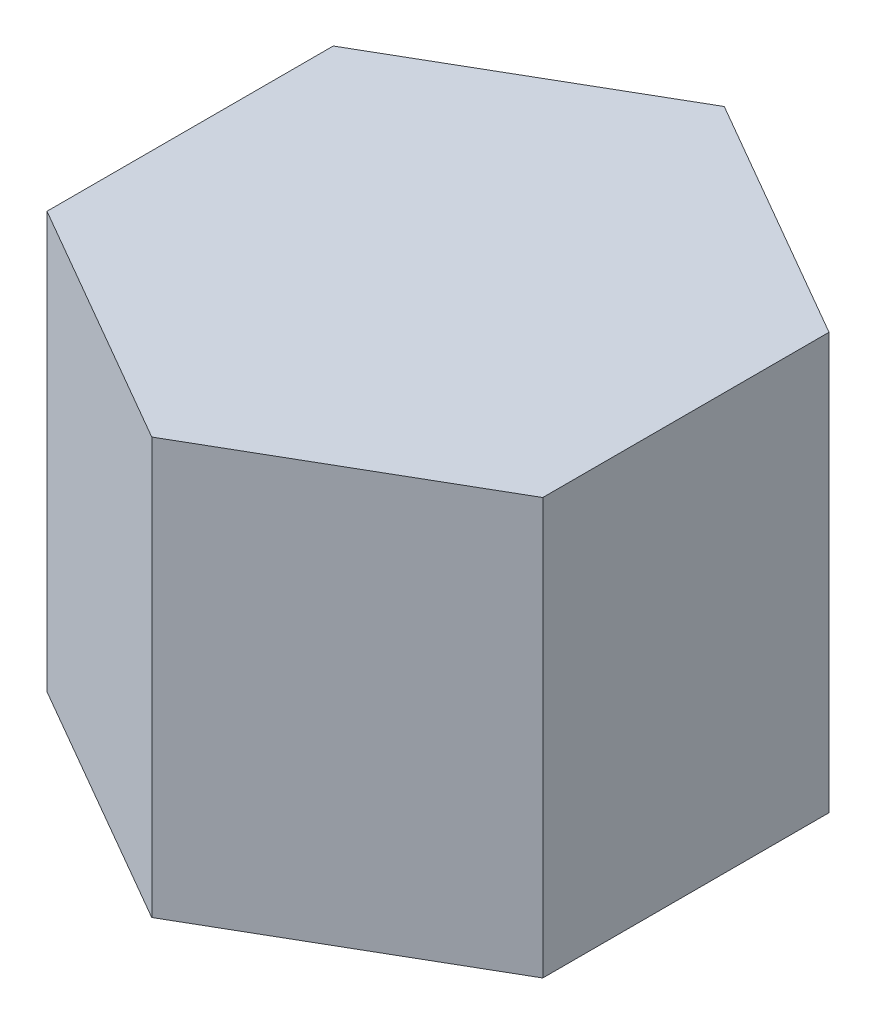
ISO-10303-21;
HEADER;
FILE_DESCRIPTION(('STEP AP214'),'2;1');
FILE_NAME('part.step','',(''),(''),'','','');
FILE_SCHEMA(('AUTOMOTIVE_DESIGN { 1 0 10303 214 1 1 1 1 }'));
ENDSEC;
DATA;
#1=APPLICATION_CONTEXT('core data for automotive mechanical design processes');
#2=APPLICATION_PROTOCOL_DEFINITION('international standard','automotive_design',2000,#1);
#3=PRODUCT_CONTEXT('',#1,'mechanical');
#4=PRODUCT('Part','Part','',(#3));
#5=PRODUCT_RELATED_PRODUCT_CATEGORY('part','',(#4));
#6=PRODUCT_DEFINITION_FORMATION('','',#4);
#7=PRODUCT_DEFINITION_CONTEXT('part definition',#1,'design');
#8=PRODUCT_DEFINITION('design','',#6,#7);
#9=PRODUCT_DEFINITION_SHAPE('','',#8);
#10=(LENGTH_UNIT() NAMED_UNIT(*) SI_UNIT(.MILLI.,.METRE.));
#11=(NAMED_UNIT(*) PLANE_ANGLE_UNIT() SI_UNIT($,.RADIAN.));
#12=(NAMED_UNIT(*) SI_UNIT($,.STERADIAN.) SOLID_ANGLE_UNIT());
#13=UNCERTAINTY_MEASURE_WITH_UNIT(LENGTH_MEASURE(1.E-05),#10,'distance_accuracy_value','');
#14=(GEOMETRIC_REPRESENTATION_CONTEXT(3) GLOBAL_UNCERTAINTY_ASSIGNED_CONTEXT((#13)) GLOBAL_UNIT_ASSIGNED_CONTEXT((#10,
#11,#12)) REPRESENTATION_CONTEXT('',''));
#15=CARTESIAN_POINT('',(0.,0.,0.));
#16=DIRECTION('',(0.,0.,1.));
#17=DIRECTION('',(1.,0.,0.));
#18=AXIS2_PLACEMENT_3D('',#15,#16,#17);
#19=CARTESIAN_POINT('',(210.339551417382,-147.556598747966,288.217869605357));
#20=DIRECTION('',(-0.499999999999978,0.,-0.866025403784452));
#21=DIRECTION('',(-0.866025403784452,0.,0.499999999999978));
#22=AXIS2_PLACEMENT_3D('',#19,#20,#21);
#23=PLANE('',#22);
#24=CARTESIAN_POINT('',(210.642660308706,-147.047793579175,288.042869605357));
#25=DIRECTION('',(-0.866025403784452,0.,0.499999999999978));
#26=VECTOR('',#25,1.);
#27=LINE('',#24,#26);
#28=CARTESIAN_POINT('',(210.642660308706,-147.047793579175,288.042869605357));
#29=VERTEX_POINT('',#28);
#30=CARTESIAN_POINT('',(210.339551417382,-147.047793579175,288.217869605357));
#31=VERTEX_POINT('',#30);
#32=EDGE_CURVE('E170',#29,#31,#27,.T.);
#33=ORIENTED_EDGE('',*,*,#32,.T.);
#34=CARTESIAN_POINT('',(210.339551417382,-147.556598747966,288.217869605357));
#35=DIRECTION('',(0.,1.,0.));
#36=VECTOR('',#35,1.);
#37=LINE('',#34,#36);
#38=CARTESIAN_POINT('',(210.339551417382,-147.556598747966,288.217869605357));
#39=VERTEX_POINT('',#38);
#40=EDGE_CURVE('E35',#39,#31,#37,.T.);
#41=ORIENTED_EDGE('',*,*,#40,.F.);
#42=CARTESIAN_POINT('',(210.642660308706,-147.556598747966,288.042869605357));
#43=DIRECTION('',(-0.866025403784452,0.,0.499999999999978));
#44=VECTOR('',#43,1.);
#45=LINE('',#42,#44);
#46=CARTESIAN_POINT('',(210.642660308706,-147.556598747966,288.042869605357));
#47=VERTEX_POINT('',#46);
#48=EDGE_CURVE('E159',#47,#39,#45,.T.);
#49=ORIENTED_EDGE('',*,*,#48,.F.);
#50=CARTESIAN_POINT('',(210.642660308706,-147.556598747966,288.042869605357));
#51=DIRECTION('',(0.,1.,0.));
#52=VECTOR('',#51,1.);
#53=LINE('',#50,#52);
#54=EDGE_CURVE('E10',#47,#29,#53,.T.);
#55=ORIENTED_EDGE('',*,*,#54,.T.);
#56=EDGE_LOOP('',(#33,#41,#49,#55));
#57=FACE_BOUND('',#56,.T.);
#58=ADVANCED_FACE('F16',(#57),#23,.F.);
#59=CARTESIAN_POINT('',(210.642660308706,-147.556598747966,291.594471220494));
#60=DIRECTION('',(-1.,0.,0.));
#61=DIRECTION('',(0.,-1.,0.));
#62=AXIS2_PLACEMENT_3D('',#59,#60,#61);
#63=PLANE('',#62);
#64=CARTESIAN_POINT('',(210.642660308706,-147.047793579175,287.692869605357));
#65=DIRECTION('',(0.,0.,1.));
#66=VECTOR('',#65,1.);
#67=LINE('',#64,#66);
#68=CARTESIAN_POINT('',(210.642660308706,-147.047793579175,287.692869605357));
#69=VERTEX_POINT('',#68);
#70=EDGE_CURVE('E167',#69,#29,#67,.T.);
#71=ORIENTED_EDGE('',*,*,#70,.T.);
#72=ORIENTED_EDGE('',*,*,#54,.F.);
#73=CARTESIAN_POINT('',(210.642660308706,-147.556598747966,287.692869605357));
#74=DIRECTION('',(0.,0.,1.));
#75=VECTOR('',#74,1.);
#76=LINE('',#73,#75);
#77=CARTESIAN_POINT('',(210.642660308706,-147.556598747966,287.692869605357));
#78=VERTEX_POINT('',#77);
#79=EDGE_CURVE('E156',#78,#47,#76,.T.);
#80=ORIENTED_EDGE('',*,*,#79,.F.);
#81=CARTESIAN_POINT('',(210.642660308706,-147.556598747966,287.692869605357));
#82=DIRECTION('',(0.,1.,0.));
#83=VECTOR('',#82,1.);
#84=LINE('',#81,#83);
#85=EDGE_CURVE('E27',#78,#69,#84,.T.);
#86=ORIENTED_EDGE('',*,*,#85,.T.);
#87=EDGE_LOOP('',(#71,#72,#80,#86));
#88=FACE_BOUND('',#87,.T.);
#89=ADVANCED_FACE('F189',(#88),#63,.F.);
#90=CARTESIAN_POINT('',(210.642660308706,-147.556598747966,287.692869605357));
#91=DIRECTION('',(-0.499999999999943,0.,0.866025403784471));
#92=DIRECTION('',(0.866025403784471,0.,0.499999999999943));
#93=AXIS2_PLACEMENT_3D('',#90,#91,#92);
#94=PLANE('',#93);
#95=CARTESIAN_POINT('',(210.339551417382,-147.047793579175,287.517869605357));
#96=DIRECTION('',(0.866025403784471,0.,0.499999999999943));
#97=VECTOR('',#96,1.);
#98=LINE('',#95,#97);
#99=CARTESIAN_POINT('',(210.339551417382,-147.047793579175,287.517869605357));
#100=VERTEX_POINT('',#99);
#101=EDGE_CURVE('E163',#100,#69,#98,.T.);
#102=ORIENTED_EDGE('',*,*,#101,.T.);
#103=ORIENTED_EDGE('',*,*,#85,.F.);
#104=CARTESIAN_POINT('',(210.339551417382,-147.556598747966,287.517869605357));
#105=DIRECTION('',(0.866025403784471,0.,0.499999999999943));
#106=VECTOR('',#105,1.);
#107=LINE('',#104,#106);
#108=CARTESIAN_POINT('',(210.339551417382,-147.556598747966,287.517869605357));
#109=VERTEX_POINT('',#108);
#110=EDGE_CURVE('E106',#109,#78,#107,.T.);
#111=ORIENTED_EDGE('',*,*,#110,.F.);
#112=CARTESIAN_POINT('',(210.339551417382,-147.556598747966,287.517869605357));
#113=DIRECTION('',(0.,1.,0.));
#114=VECTOR('',#113,1.);
#115=LINE('',#112,#114);
#116=EDGE_CURVE('E94',#109,#100,#115,.T.);
#117=ORIENTED_EDGE('',*,*,#116,.T.);
#118=EDGE_LOOP('',(#102,#103,#111,#117));
#119=FACE_BOUND('',#118,.T.);
#120=ADVANCED_FACE('F198',(#119),#94,.F.);
#121=CARTESIAN_POINT('',(210.339551417382,-147.556598747966,287.517869605357));
#122=DIRECTION('',(0.499999999999978,0.,0.866025403784452));
#123=DIRECTION('',(0.866025403784452,0.,-0.499999999999978));
#124=AXIS2_PLACEMENT_3D('',#121,#122,#123);
#125=PLANE('',#124);
#126=CARTESIAN_POINT('',(210.036442526057,-147.047793579175,287.692869605357));
#127=DIRECTION('',(0.866025403784452,0.,-0.499999999999978));
#128=VECTOR('',#127,1.);
#129=LINE('',#126,#128);
#130=CARTESIAN_POINT('',(210.036442526057,-147.047793579175,287.692869605357));
#131=VERTEX_POINT('',#130);
#132=EDGE_CURVE('E162',#131,#100,#129,.T.);
#133=ORIENTED_EDGE('',*,*,#132,.T.);
#134=ORIENTED_EDGE('',*,*,#116,.F.);
#135=CARTESIAN_POINT('',(210.036442526057,-147.556598747966,287.692869605357));
#136=DIRECTION('',(0.866025403784452,0.,-0.499999999999978));
#137=VECTOR('',#136,1.);
#138=LINE('',#135,#137);
#139=CARTESIAN_POINT('',(210.036442526057,-147.556598747966,287.692869605357));
#140=VERTEX_POINT('',#139);
#141=EDGE_CURVE('E98',#140,#109,#138,.T.);
#142=ORIENTED_EDGE('',*,*,#141,.F.);
#143=CARTESIAN_POINT('',(210.036442526057,-147.556598747966,287.692869605357));
#144=DIRECTION('',(0.,1.,0.));
#145=VECTOR('',#144,1.);
#146=LINE('',#143,#145);
#147=EDGE_CURVE('E79',#140,#131,#146,.T.);
#148=ORIENTED_EDGE('',*,*,#147,.T.);
#149=EDGE_LOOP('',(#133,#134,#142,#148));
#150=FACE_BOUND('',#149,.T.);
#151=ADVANCED_FACE('F100',(#150),#125,.F.);
#152=CARTESIAN_POINT('',(210.036442526057,-147.556598747966,291.594471220494));
#153=DIRECTION('',(1.,0.,0.));
#154=DIRECTION('',(0.,1.,0.));
#155=AXIS2_PLACEMENT_3D('',#152,#153,#154);
#156=PLANE('',#155);
#157=CARTESIAN_POINT('',(210.036442526057,-147.047793579175,288.042869605357));
#158=DIRECTION('',(0.,0.,-1.));
#159=VECTOR('',#158,1.);
#160=LINE('',#157,#159);
#161=CARTESIAN_POINT('',(210.036442526057,-147.047793579175,288.042869605357));
#162=VERTEX_POINT('',#161);
#163=EDGE_CURVE('E88',#162,#131,#160,.T.);
#164=ORIENTED_EDGE('',*,*,#163,.T.);
#165=ORIENTED_EDGE('',*,*,#147,.F.);
#166=CARTESIAN_POINT('',(210.036442526057,-147.556598747966,288.042869605357));
#167=DIRECTION('',(0.,0.,-1.));
#168=VECTOR('',#167,1.);
#169=LINE('',#166,#168);
#170=CARTESIAN_POINT('',(210.036442526057,-147.556598747966,288.042869605357));
#171=VERTEX_POINT('',#170);
#172=EDGE_CURVE('E84',#171,#140,#169,.T.);
#173=ORIENTED_EDGE('',*,*,#172,.F.);
#174=CARTESIAN_POINT('',(210.036442526057,-147.556598747966,288.042869605357));
#175=DIRECTION('',(0.,1.,0.));
#176=VECTOR('',#175,1.);
#177=LINE('',#174,#176);
#178=EDGE_CURVE('E58',#171,#162,#177,.T.);
#179=ORIENTED_EDGE('',*,*,#178,.T.);
#180=EDGE_LOOP('',(#164,#165,#173,#179));
#181=FACE_BOUND('',#180,.T.);
#182=ADVANCED_FACE('F82',(#181),#156,.F.);
#183=CARTESIAN_POINT('',(210.036442526057,-147.556598747966,288.042869605357));
#184=DIRECTION('',(0.499999999999943,0.,-0.866025403784471));
#185=DIRECTION('',(-0.866025403784471,0.,-0.499999999999943));
#186=AXIS2_PLACEMENT_3D('',#183,#184,#185);
#187=PLANE('',#186);
#188=CARTESIAN_POINT('',(210.339551417382,-147.047793579175,288.217869605357));
#189=DIRECTION('',(-0.866025403784471,0.,-0.499999999999943));
#190=VECTOR('',#189,1.);
#191=LINE('',#188,#190);
#192=EDGE_CURVE('E160',#31,#162,#191,.T.);
#193=ORIENTED_EDGE('',*,*,#192,.T.);
#194=ORIENTED_EDGE('',*,*,#178,.F.);
#195=CARTESIAN_POINT('',(210.339551417382,-147.556598747966,288.217869605357));
#196=DIRECTION('',(-0.866025403784471,0.,-0.499999999999943));
#197=VECTOR('',#196,1.);
#198=LINE('',#195,#197);
#199=EDGE_CURVE('E112',#39,#171,#198,.T.);
#200=ORIENTED_EDGE('',*,*,#199,.F.);
#201=ORIENTED_EDGE('',*,*,#40,.T.);
#202=EDGE_LOOP('',(#193,#194,#200,#201));
#203=FACE_BOUND('',#202,.T.);
#204=ADVANCED_FACE('F131',(#203),#187,.F.);
#205=CARTESIAN_POINT('',(206.491105863044,-147.556598747966,291.594471220494));
#206=DIRECTION('',(0.,1.,0.));
#207=DIRECTION('',(-1.,0.,0.));
#208=AXIS2_PLACEMENT_3D('',#205,#206,#207);
#209=PLANE('',#208);
#210=ORIENTED_EDGE('',*,*,#48,.T.);
#211=ORIENTED_EDGE('',*,*,#199,.T.);
#212=ORIENTED_EDGE('',*,*,#172,.T.);
#213=ORIENTED_EDGE('',*,*,#141,.T.);
#214=ORIENTED_EDGE('',*,*,#110,.T.);
#215=ORIENTED_EDGE('',*,*,#79,.T.);
#216=EDGE_LOOP('',(#210,#211,#212,#213,#214,#215));
#217=FACE_BOUND('',#216,.T.);
#218=ADVANCED_FACE('F111',(#217),#209,.F.);
#219=CARTESIAN_POINT('',(206.491105863044,-147.047793579175,291.594471220494));
#220=DIRECTION('',(0.,1.,0.));
#221=DIRECTION('',(-1.,0.,0.));
#222=AXIS2_PLACEMENT_3D('',#219,#220,#221);
#223=PLANE('',#222);
#224=ORIENTED_EDGE('',*,*,#32,.F.);
#225=ORIENTED_EDGE('',*,*,#70,.F.);
#226=ORIENTED_EDGE('',*,*,#101,.F.);
#227=ORIENTED_EDGE('',*,*,#132,.F.);
#228=ORIENTED_EDGE('',*,*,#163,.F.);
#229=ORIENTED_EDGE('',*,*,#192,.F.);
#230=EDGE_LOOP('',(#224,#225,#226,#227,#228,#229));
#231=FACE_BOUND('',#230,.T.);
#232=ADVANCED_FACE('F130',(#231),#223,.T.);
#233=CLOSED_SHELL('',(#58,#89,#120,#151,#182,#204,#218,#232));
#234=MANIFOLD_SOLID_BREP('B1',#233);
#235=ADVANCED_BREP_SHAPE_REPRESENTATION('',(#18,#234),#14);
#236=SHAPE_DEFINITION_REPRESENTATION(#9,#235);
ENDSEC;
END-ISO-10303-21;
